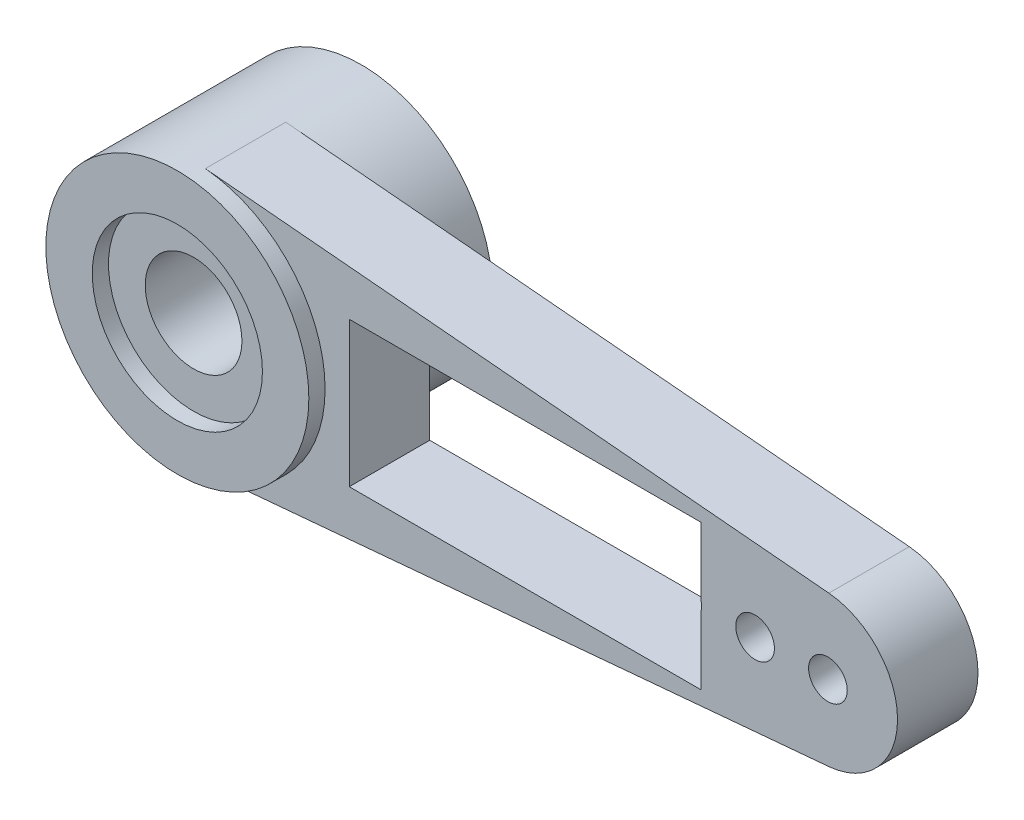
ISO-10303-21;
HEADER;
FILE_DESCRIPTION(('STEP AP214'),'2;1');
FILE_NAME('part.step','',(''),(''),'','','');
FILE_SCHEMA(('AUTOMOTIVE_DESIGN { 1 0 10303 214 1 1 1 1 }'));
ENDSEC;
DATA;
#1=APPLICATION_CONTEXT('core data for automotive mechanical design processes');
#2=APPLICATION_PROTOCOL_DEFINITION('international standard','automotive_design',2000,#1);
#3=PRODUCT_CONTEXT('',#1,'mechanical');
#4=PRODUCT('Part','Part','',(#3));
#5=PRODUCT_RELATED_PRODUCT_CATEGORY('part','',(#4));
#6=PRODUCT_DEFINITION_FORMATION('','',#4);
#7=PRODUCT_DEFINITION_CONTEXT('part definition',#1,'design');
#8=PRODUCT_DEFINITION('design','',#6,#7);
#9=PRODUCT_DEFINITION_SHAPE('','',#8);
#10=(LENGTH_UNIT() NAMED_UNIT(*) SI_UNIT(.MILLI.,.METRE.));
#11=(NAMED_UNIT(*) PLANE_ANGLE_UNIT() SI_UNIT($,.RADIAN.));
#12=(NAMED_UNIT(*) SI_UNIT($,.STERADIAN.) SOLID_ANGLE_UNIT());
#13=UNCERTAINTY_MEASURE_WITH_UNIT(LENGTH_MEASURE(1.E-05),#10,'distance_accuracy_value','');
#14=(GEOMETRIC_REPRESENTATION_CONTEXT(3) GLOBAL_UNCERTAINTY_ASSIGNED_CONTEXT((#13)) GLOBAL_UNIT_ASSIGNED_CONTEXT((#10,
#11,#12)) REPRESENTATION_CONTEXT('',''));
#15=CARTESIAN_POINT('',(0.,0.,0.));
#16=DIRECTION('',(0.,0.,1.));
#17=DIRECTION('',(1.,0.,0.));
#18=AXIS2_PLACEMENT_3D('',#15,#16,#17);
#19=CARTESIAN_POINT('',(0.,0.,2.08));
#20=DIRECTION('',(0.,0.,1.));
#21=DIRECTION('',(1.,0.,0.));
#22=AXIS2_PLACEMENT_3D('',#19,#20,#21);
#23=PLANE('',#22);
#24=CARTESIAN_POINT('',(0.,0.,2.08));
#25=DIRECTION('',(0.,0.,1.));
#26=DIRECTION('',(1.,0.,0.));
#27=AXIS2_PLACEMENT_3D('',#24,#25,#26);
#28=CIRCLE('',#27,1.25);
#29=CARTESIAN_POINT('',(1.25,0.,2.08));
#30=VERTEX_POINT('',#29);
#31=EDGE_CURVE('E206',#30,#30,#28,.T.);
#32=ORIENTED_EDGE('',*,*,#31,.F.);
#33=EDGE_LOOP('',(#32));
#34=FACE_BOUND('',#33,.T.);
#35=CARTESIAN_POINT('',(0.,0.,2.08));
#36=DIRECTION('',(0.,0.,1.));
#37=DIRECTION('',(1.,0.,0.));
#38=AXIS2_PLACEMENT_3D('',#35,#36,#37);
#39=CIRCLE('',#38,2.2);
#40=CARTESIAN_POINT('',(2.2,0.,2.08));
#41=VERTEX_POINT('',#40);
#42=EDGE_CURVE('E185',#41,#41,#39,.T.);
#43=ORIENTED_EDGE('',*,*,#42,.T.);
#44=EDGE_LOOP('',(#43));
#45=FACE_BOUND('',#44,.T.);
#46=ADVANCED_FACE('F42',(#34,#45),#23,.T.);
#47=CARTESIAN_POINT('',(0.,0.,0.));
#48=DIRECTION('',(0.,0.,1.));
#49=DIRECTION('',(1.,0.,0.));
#50=AXIS2_PLACEMENT_3D('',#47,#48,#49);
#51=PLANE('',#50);
#52=CARTESIAN_POINT('',(0.,0.,0.));
#53=DIRECTION('',(0.,0.,1.));
#54=DIRECTION('',(1.,0.,0.));
#55=AXIS2_PLACEMENT_3D('',#52,#53,#54);
#56=CIRCLE('',#55,1.25);
#57=CARTESIAN_POINT('',(1.25,0.,0.));
#58=VERTEX_POINT('',#57);
#59=EDGE_CURVE('E193',#58,#58,#56,.T.);
#60=ORIENTED_EDGE('',*,*,#59,.T.);
#61=EDGE_LOOP('',(#60));
#62=FACE_BOUND('',#61,.T.);
#63=CARTESIAN_POINT('',(0.,0.,0.));
#64=DIRECTION('',(0.,0.,1.));
#65=DIRECTION('',(1.,0.,0.));
#66=AXIS2_PLACEMENT_3D('',#63,#64,#65);
#67=CIRCLE('',#66,2.2);
#68=CARTESIAN_POINT('',(2.2,0.,0.));
#69=VERTEX_POINT('',#68);
#70=EDGE_CURVE('E50',#69,#69,#67,.T.);
#71=ORIENTED_EDGE('',*,*,#70,.F.);
#72=EDGE_LOOP('',(#71));
#73=FACE_BOUND('',#72,.T.);
#74=ADVANCED_FACE('F241',(#62,#73),#51,.F.);
#75=CARTESIAN_POINT('',(0.,0.,2.08));
#76=DIRECTION('',(0.,0.,-1.));
#77=DIRECTION('',(-1.,0.,0.));
#78=AXIS2_PLACEMENT_3D('',#75,#76,#77);
#79=CYLINDRICAL_SURFACE('',#78,1.25);
#80=ORIENTED_EDGE('',*,*,#31,.T.);
#81=EDGE_LOOP('',(#80));
#82=FACE_BOUND('',#81,.T.);
#83=ORIENTED_EDGE('',*,*,#59,.F.);
#84=EDGE_LOOP('',(#83));
#85=FACE_BOUND('',#84,.T.);
#86=ADVANCED_FACE('F243',(#82,#85),#79,.F.);
#87=CARTESIAN_POINT('',(0.,0.,-2.25));
#88=DIRECTION('',(0.,0.,1.));
#89=DIRECTION('',(1.,0.,0.));
#90=AXIS2_PLACEMENT_3D('',#87,#88,#89);
#91=CYLINDRICAL_SURFACE('',#90,2.2);
#92=CARTESIAN_POINT('',(0.,0.,-2.25));
#93=DIRECTION('',(0.,0.,1.));
#94=DIRECTION('',(1.,0.,0.));
#95=AXIS2_PLACEMENT_3D('',#92,#93,#94);
#96=CIRCLE('',#95,2.2);
#97=CARTESIAN_POINT('',(2.2,0.,-2.25));
#98=VERTEX_POINT('',#97);
#99=EDGE_CURVE('E178',#98,#98,#96,.T.);
#100=ORIENTED_EDGE('',*,*,#99,.F.);
#101=EDGE_LOOP('',(#100));
#102=FACE_BOUND('',#101,.T.);
#103=ORIENTED_EDGE('',*,*,#70,.T.);
#104=EDGE_LOOP('',(#103));
#105=FACE_BOUND('',#104,.T.);
#106=ADVANCED_FACE('F239',(#102,#105),#91,.F.);
#107=CARTESIAN_POINT('',(0.,0.,-2.25));
#108=DIRECTION('',(0.,0.,1.));
#109=DIRECTION('',(1.,0.,0.));
#110=AXIS2_PLACEMENT_3D('',#107,#108,#109);
#111=PLANE('',#110);
#112=ORIENTED_EDGE('',*,*,#99,.T.);
#113=EDGE_LOOP('',(#112));
#114=FACE_BOUND('',#113,.T.);
#115=CARTESIAN_POINT('',(0.,0.,-2.25));
#116=DIRECTION('',(0.,0.,1.));
#117=DIRECTION('',(1.,0.,0.));
#118=AXIS2_PLACEMENT_3D('',#115,#116,#117);
#119=CIRCLE('',#118,3.4);
#120=CARTESIAN_POINT('',(3.4,0.,-2.25));
#121=VERTEX_POINT('',#120);
#122=EDGE_CURVE('E181',#121,#121,#119,.T.);
#123=ORIENTED_EDGE('',*,*,#122,.F.);
#124=EDGE_LOOP('',(#123));
#125=FACE_BOUND('',#124,.T.);
#126=ADVANCED_FACE('F312',(#114,#125),#111,.F.);
#127=ORIENTED_EDGE('',*,*,#42,.F.);
#128=EDGE_LOOP('',(#127));
#129=FACE_BOUND('',#128,.T.);
#130=CARTESIAN_POINT('',(0.,0.,2.5));
#131=DIRECTION('',(0.,0.,1.));
#132=DIRECTION('',(1.,0.,0.));
#133=AXIS2_PLACEMENT_3D('',#130,#131,#132);
#134=CIRCLE('',#133,2.2);
#135=CARTESIAN_POINT('',(2.2,0.,2.5));
#136=VERTEX_POINT('',#135);
#137=EDGE_CURVE('E172',#136,#136,#134,.T.);
#138=ORIENTED_EDGE('',*,*,#137,.T.);
#139=EDGE_LOOP('',(#138));
#140=FACE_BOUND('',#139,.T.);
#141=ADVANCED_FACE('F306',(#129,#140),#91,.F.);
#142=CARTESIAN_POINT('',(0.,0.,2.5));
#143=DIRECTION('',(0.,0.,1.));
#144=DIRECTION('',(1.,0.,0.));
#145=AXIS2_PLACEMENT_3D('',#142,#143,#144);
#146=PLANE('',#145);
#147=ORIENTED_EDGE('',*,*,#137,.F.);
#148=EDGE_LOOP('',(#147));
#149=FACE_BOUND('',#148,.T.);
#150=CARTESIAN_POINT('',(0.,0.,2.5));
#151=DIRECTION('',(0.,0.,1.));
#152=DIRECTION('',(1.,0.,0.));
#153=AXIS2_PLACEMENT_3D('',#150,#151,#152);
#154=CIRCLE('',#153,3.4);
#155=CARTESIAN_POINT('',(3.4,0.,2.5));
#156=VERTEX_POINT('',#155);
#157=EDGE_CURVE('E175',#156,#156,#154,.T.);
#158=ORIENTED_EDGE('',*,*,#157,.T.);
#159=EDGE_LOOP('',(#158));
#160=FACE_BOUND('',#159,.T.);
#161=ADVANCED_FACE('F291',(#149,#160),#146,.T.);
#162=CARTESIAN_POINT('',(16.25,0.,2.08));
#163=DIRECTION('',(0.,0.,-1.));
#164=DIRECTION('',(-1.,0.,0.));
#165=AXIS2_PLACEMENT_3D('',#162,#163,#164);
#166=CYLINDRICAL_SURFACE('',#165,1.95);
#167=CARTESIAN_POINT('',(16.25,0.,0.));
#168=DIRECTION('',(0.,0.,1.));
#169=DIRECTION('',(1.,0.,0.));
#170=AXIS2_PLACEMENT_3D('',#167,#168,#169);
#171=CIRCLE('',#170,1.95);
#172=CARTESIAN_POINT('',(16.424,-1.94222140859378,0.));
#173=VERTEX_POINT('',#172);
#174=CARTESIAN_POINT('',(16.424,1.94222140859378,0.));
#175=VERTEX_POINT('',#174);
#176=EDGE_CURVE('E220',#173,#175,#171,.T.);
#177=ORIENTED_EDGE('',*,*,#176,.T.);
#178=DIRECTION('',(0.,0.,-1.));
#179=VECTOR('',#178,1.);
#180=CARTESIAN_POINT('',(16.424,1.94222140859378,2.08));
#181=LINE('',#180,#179);
#182=CARTESIAN_POINT('',(16.424,1.94222140859378,2.08));
#183=VERTEX_POINT('',#182);
#184=EDGE_CURVE('E232',#183,#175,#181,.T.);
#185=ORIENTED_EDGE('',*,*,#184,.F.);
#186=CARTESIAN_POINT('',(16.25,0.,2.08));
#187=DIRECTION('',(0.,0.,1.));
#188=DIRECTION('',(1.,0.,0.));
#189=AXIS2_PLACEMENT_3D('',#186,#187,#188);
#190=CIRCLE('',#189,1.95);
#191=CARTESIAN_POINT('',(16.424,-1.94222140859378,2.08));
#192=VERTEX_POINT('',#191);
#193=EDGE_CURVE('E201',#192,#183,#190,.T.);
#194=ORIENTED_EDGE('',*,*,#193,.F.);
#195=DIRECTION('',(0.,0.,-1.));
#196=VECTOR('',#195,1.);
#197=CARTESIAN_POINT('',(16.424,-1.94222140859378,2.08));
#198=LINE('',#197,#196);
#199=EDGE_CURVE('E90',#192,#173,#198,.T.);
#200=ORIENTED_EDGE('',*,*,#199,.T.);
#201=EDGE_LOOP('',(#177,#185,#194,#200));
#202=FACE_BOUND('',#201,.T.);
#203=ADVANCED_FACE('F288',(#202),#166,.T.);
#204=CARTESIAN_POINT('',(0.303384615384615,3.38643732780454,2.08));
#205=DIRECTION('',(-0.0892307692307693,-0.99601097876604,0.));
#206=DIRECTION('',(0.99601097876604,-0.0892307692307693,0.));
#207=AXIS2_PLACEMENT_3D('',#204,#205,#206);
#208=PLANE('',#207);
#209=DIRECTION('',(-0.99601097876604,0.0892307692307693,0.));
#210=VECTOR('',#209,1.);
#211=CARTESIAN_POINT('',(0.303384615384615,3.38643732780454,0.));
#212=LINE('',#211,#210);
#213=CARTESIAN_POINT('',(0.303384615384616,3.38643732780454,0.));
#214=VERTEX_POINT('',#213);
#215=EDGE_CURVE('E223',#175,#214,#212,.T.);
#216=ORIENTED_EDGE('',*,*,#215,.T.);
#217=DIRECTION('',(0.,0.,-1.));
#218=VECTOR('',#217,1.);
#219=CARTESIAN_POINT('',(0.303384615384616,3.38643732780454,2.08));
#220=LINE('',#219,#218);
#221=CARTESIAN_POINT('',(0.303384615384616,3.38643732780454,2.08));
#222=VERTEX_POINT('',#221);
#223=EDGE_CURVE('E230',#222,#214,#220,.T.);
#224=ORIENTED_EDGE('',*,*,#223,.F.);
#225=DIRECTION('',(-0.99601097876604,0.0892307692307693,0.));
#226=VECTOR('',#225,1.);
#227=CARTESIAN_POINT('',(0.303384615384615,3.38643732780454,2.08));
#228=LINE('',#227,#226);
#229=EDGE_CURVE('E204',#183,#222,#228,.T.);
#230=ORIENTED_EDGE('',*,*,#229,.F.);
#231=ORIENTED_EDGE('',*,*,#184,.T.);
#232=EDGE_LOOP('',(#216,#224,#230,#231));
#233=FACE_BOUND('',#232,.T.);
#234=ADVANCED_FACE('F290',(#233),#208,.F.);
#235=CARTESIAN_POINT('',(0.,0.,2.08));
#236=DIRECTION('',(0.,0.,-1.));
#237=DIRECTION('',(-1.,0.,0.));
#238=AXIS2_PLACEMENT_3D('',#235,#236,#237);
#239=CYLINDRICAL_SURFACE('',#238,3.4);
#240=ORIENTED_EDGE('',*,*,#223,.T.);
#241=CARTESIAN_POINT('',(0.,0.,0.));
#242=DIRECTION('',(0.,0.,1.));
#243=DIRECTION('',(1.,0.,0.));
#244=AXIS2_PLACEMENT_3D('',#241,#242,#243);
#245=CIRCLE('',#244,3.4);
#246=CARTESIAN_POINT('',(0.303384615384615,-3.38643732780453,0.));
#247=VERTEX_POINT('',#246);
#248=EDGE_CURVE('E84',#247,#214,#245,.T.);
#249=ORIENTED_EDGE('',*,*,#248,.F.);
#250=DIRECTION('',(0.,0.,-1.));
#251=VECTOR('',#250,1.);
#252=CARTESIAN_POINT('',(0.303384615384616,-3.38643732780454,2.08));
#253=LINE('',#252,#251);
#254=CARTESIAN_POINT('',(0.303384615384616,-3.38643732780454,2.08));
#255=VERTEX_POINT('',#254);
#256=EDGE_CURVE('E209',#255,#247,#253,.T.);
#257=ORIENTED_EDGE('',*,*,#256,.F.);
#258=CARTESIAN_POINT('',(0.,0.,2.08));
#259=DIRECTION('',(0.,0.,1.));
#260=DIRECTION('',(1.,0.,0.));
#261=AXIS2_PLACEMENT_3D('',#258,#259,#260);
#262=CIRCLE('',#261,3.4);
#263=EDGE_CURVE('E66',#255,#222,#262,.T.);
#264=ORIENTED_EDGE('',*,*,#263,.T.);
#265=EDGE_LOOP('',(#240,#249,#257,#264));
#266=FACE_BOUND('',#265,.T.);
#267=ORIENTED_EDGE('',*,*,#122,.T.);
#268=EDGE_LOOP('',(#267));
#269=FACE_BOUND('',#268,.T.);
#270=ORIENTED_EDGE('',*,*,#157,.F.);
#271=EDGE_LOOP('',(#270));
#272=FACE_BOUND('',#271,.T.);
#273=ADVANCED_FACE('F287',(#266,#269,#272),#239,.T.);
#274=CARTESIAN_POINT('',(0.303384615384616,-3.38643732780454,2.08));
#275=DIRECTION('',(0.0892307692307693,-0.99601097876604,0.));
#276=DIRECTION('',(0.99601097876604,0.0892307692307693,0.));
#277=AXIS2_PLACEMENT_3D('',#274,#275,#276);
#278=PLANE('',#277);
#279=DIRECTION('',(-0.99601097876604,-0.0892307692307693,0.));
#280=VECTOR('',#279,1.);
#281=CARTESIAN_POINT('',(0.303384615384616,-3.38643732780454,0.));
#282=LINE('',#281,#280);
#283=EDGE_CURVE('E218',#173,#247,#282,.T.);
#284=ORIENTED_EDGE('',*,*,#283,.F.);
#285=ORIENTED_EDGE('',*,*,#199,.F.);
#286=DIRECTION('',(-0.99601097876604,-0.0892307692307693,0.));
#287=VECTOR('',#286,1.);
#288=CARTESIAN_POINT('',(0.303384615384616,-3.38643732780454,2.08));
#289=LINE('',#288,#287);
#290=EDGE_CURVE('E199',#192,#255,#289,.T.);
#291=ORIENTED_EDGE('',*,*,#290,.T.);
#292=ORIENTED_EDGE('',*,*,#256,.T.);
#293=EDGE_LOOP('',(#284,#285,#291,#292));
#294=FACE_BOUND('',#293,.T.);
#295=ADVANCED_FACE('F281',(#294),#278,.T.);
#296=CARTESIAN_POINT('',(12.6333333333333,0.,2.08));
#297=DIRECTION('',(0.,0.,-1.));
#298=DIRECTION('',(-1.,0.,0.));
#299=AXIS2_PLACEMENT_3D('',#296,#297,#298);
#300=CYLINDRICAL_SURFACE('',#299,0.500000000000001);
#301=DIRECTION('',(0.,0.,-1.));
#302=VECTOR('',#301,1.);
#303=CARTESIAN_POINT('',(13.125,-0.0909059342886467,2.08));
#304=LINE('',#303,#302);
#305=CARTESIAN_POINT('',(13.125,-0.0909059342886467,2.08));
#306=VERTEX_POINT('',#305);
#307=CARTESIAN_POINT('',(13.125,-0.0909059342886467,0.));
#308=VERTEX_POINT('',#307);
#309=EDGE_CURVE('E170',#306,#308,#304,.T.);
#310=ORIENTED_EDGE('',*,*,#309,.F.);
#311=CARTESIAN_POINT('',(12.6333333333333,0.,2.08));
#312=DIRECTION('',(0.,0.,1.));
#313=DIRECTION('',(1.,0.,0.));
#314=AXIS2_PLACEMENT_3D('',#311,#312,#313);
#315=CIRCLE('',#314,0.500000000000001);
#316=CARTESIAN_POINT('',(13.125,0.0909059342886467,2.08));
#317=VERTEX_POINT('',#316);
#318=EDGE_CURVE('E196',#306,#317,#315,.T.);
#319=ORIENTED_EDGE('',*,*,#318,.T.);
#320=DIRECTION('',(0.,0.,-1.));
#321=VECTOR('',#320,1.);
#322=CARTESIAN_POINT('',(13.125,0.0909059342886467,2.08));
#323=LINE('',#322,#321);
#324=CARTESIAN_POINT('',(13.125,0.0909059342886465,0.));
#325=VERTEX_POINT('',#324);
#326=EDGE_CURVE('E167',#325,#317,#323,.F.);
#327=ORIENTED_EDGE('',*,*,#326,.F.);
#328=CARTESIAN_POINT('',(12.6333333333333,0.,0.));
#329=DIRECTION('',(0.,0.,1.));
#330=DIRECTION('',(1.,0.,0.));
#331=AXIS2_PLACEMENT_3D('',#328,#329,#330);
#332=CIRCLE('',#331,0.500000000000001);
#333=EDGE_CURVE('E215',#308,#325,#332,.T.);
#334=ORIENTED_EDGE('',*,*,#333,.F.);
#335=EDGE_LOOP('',(#310,#319,#327,#334));
#336=FACE_BOUND('',#335,.T.);
#337=ADVANCED_FACE('F274',(#336),#300,.F.);
#338=CARTESIAN_POINT('',(14.5166666666667,0.,2.08));
#339=DIRECTION('',(0.,0.,-1.));
#340=DIRECTION('',(-1.,0.,0.));
#341=AXIS2_PLACEMENT_3D('',#338,#339,#340);
#342=CYLINDRICAL_SURFACE('',#341,0.500000000000001);
#343=CARTESIAN_POINT('',(14.5166666666667,0.,2.08));
#344=DIRECTION('',(0.,0.,1.));
#345=DIRECTION('',(1.,0.,0.));
#346=AXIS2_PLACEMENT_3D('',#343,#344,#345);
#347=CIRCLE('',#346,0.500000000000001);
#348=CARTESIAN_POINT('',(15.0166666666667,0.,2.08));
#349=VERTEX_POINT('',#348);
#350=EDGE_CURVE('E192',#349,#349,#347,.T.);
#351=ORIENTED_EDGE('',*,*,#350,.T.);
#352=EDGE_LOOP('',(#351));
#353=FACE_BOUND('',#352,.T.);
#354=CARTESIAN_POINT('',(14.5166666666667,0.,0.));
#355=DIRECTION('',(0.,0.,1.));
#356=DIRECTION('',(1.,0.,0.));
#357=AXIS2_PLACEMENT_3D('',#354,#355,#356);
#358=CIRCLE('',#357,0.500000000000001);
#359=CARTESIAN_POINT('',(15.0166666666667,0.,0.));
#360=VERTEX_POINT('',#359);
#361=EDGE_CURVE('E212',#360,#360,#358,.T.);
#362=ORIENTED_EDGE('',*,*,#361,.F.);
#363=EDGE_LOOP('',(#362));
#364=FACE_BOUND('',#363,.T.);
#365=ADVANCED_FACE('F272',(#353,#364),#342,.F.);
#366=DIRECTION('',(0.,1.,0.));
#367=VECTOR('',#366,1.);
#368=CARTESIAN_POINT('',(13.125,0.,2.08));
#369=LINE('',#368,#367);
#370=CARTESIAN_POINT('',(13.125,-1.875,2.08));
#371=VERTEX_POINT('',#370);
#372=EDGE_CURVE('E168',#371,#306,#369,.T.);
#373=ORIENTED_EDGE('',*,*,#372,.F.);
#374=DIRECTION('',(1.,0.,0.));
#375=VECTOR('',#374,1.);
#376=CARTESIAN_POINT('',(0.,-1.875,2.08));
#377=LINE('',#376,#375);
#378=CARTESIAN_POINT('',(4.025,-1.875,2.08));
#379=VERTEX_POINT('',#378);
#380=EDGE_CURVE('E158',#379,#371,#377,.T.);
#381=ORIENTED_EDGE('',*,*,#380,.F.);
#382=DIRECTION('',(0.,-1.,0.));
#383=VECTOR('',#382,1.);
#384=CARTESIAN_POINT('',(4.025,0.,2.08));
#385=LINE('',#384,#383);
#386=CARTESIAN_POINT('',(4.025,1.875,2.08));
#387=VERTEX_POINT('',#386);
#388=EDGE_CURVE('E138',#387,#379,#385,.T.);
#389=ORIENTED_EDGE('',*,*,#388,.F.);
#390=DIRECTION('',(-1.,0.,0.));
#391=VECTOR('',#390,1.);
#392=CARTESIAN_POINT('',(0.,1.875,2.08));
#393=LINE('',#392,#391);
#394=CARTESIAN_POINT('',(13.125,1.875,2.08));
#395=VERTEX_POINT('',#394);
#396=EDGE_CURVE('E163',#395,#387,#393,.T.);
#397=ORIENTED_EDGE('',*,*,#396,.F.);
#398=EDGE_CURVE('E165',#317,#395,#369,.T.);
#399=ORIENTED_EDGE('',*,*,#398,.F.);
#400=ORIENTED_EDGE('',*,*,#318,.F.);
#401=EDGE_LOOP('',(#373,#381,#389,#397,#399,#400));
#402=FACE_BOUND('',#401,.T.);
#403=ORIENTED_EDGE('',*,*,#263,.F.);
#404=ORIENTED_EDGE('',*,*,#290,.F.);
#405=ORIENTED_EDGE('',*,*,#193,.T.);
#406=ORIENTED_EDGE('',*,*,#229,.T.);
#407=EDGE_LOOP('',(#403,#404,#405,#406));
#408=FACE_BOUND('',#407,.T.);
#409=CARTESIAN_POINT('',(16.4,0.,2.08));
#410=DIRECTION('',(0.,0.,1.));
#411=DIRECTION('',(1.,0.,0.));
#412=AXIS2_PLACEMENT_3D('',#409,#410,#411);
#413=CIRCLE('',#412,0.499999999999999);
#414=CARTESIAN_POINT('',(16.9,0.,2.08));
#415=VERTEX_POINT('',#414);
#416=EDGE_CURVE('E189',#415,#415,#413,.T.);
#417=ORIENTED_EDGE('',*,*,#416,.F.);
#418=EDGE_LOOP('',(#417));
#419=FACE_BOUND('',#418,.T.);
#420=ORIENTED_EDGE('',*,*,#350,.F.);
#421=EDGE_LOOP('',(#420));
#422=FACE_BOUND('',#421,.T.);
#423=ADVANCED_FACE('F255',(#402,#408,#419,#422),#23,.T.);
#424=CARTESIAN_POINT('',(16.4,0.,2.08));
#425=DIRECTION('',(0.,0.,-1.));
#426=DIRECTION('',(-1.,0.,0.));
#427=AXIS2_PLACEMENT_3D('',#424,#425,#426);
#428=CYLINDRICAL_SURFACE('',#427,0.499999999999999);
#429=ORIENTED_EDGE('',*,*,#416,.T.);
#430=EDGE_LOOP('',(#429));
#431=FACE_BOUND('',#430,.T.);
#432=CARTESIAN_POINT('',(16.4,0.,0.));
#433=DIRECTION('',(0.,0.,1.));
#434=DIRECTION('',(1.,0.,0.));
#435=AXIS2_PLACEMENT_3D('',#432,#433,#434);
#436=CIRCLE('',#435,0.499999999999999);
#437=CARTESIAN_POINT('',(16.9,0.,0.));
#438=VERTEX_POINT('',#437);
#439=EDGE_CURVE('E188',#438,#438,#436,.T.);
#440=ORIENTED_EDGE('',*,*,#439,.F.);
#441=EDGE_LOOP('',(#440));
#442=FACE_BOUND('',#441,.T.);
#443=ADVANCED_FACE('F44',(#431,#442),#428,.F.);
#444=ORIENTED_EDGE('',*,*,#439,.T.);
#445=EDGE_LOOP('',(#444));
#446=FACE_BOUND('',#445,.T.);
#447=ORIENTED_EDGE('',*,*,#361,.T.);
#448=EDGE_LOOP('',(#447));
#449=FACE_BOUND('',#448,.T.);
#450=DIRECTION('',(-1.,0.,0.));
#451=VECTOR('',#450,1.);
#452=CARTESIAN_POINT('',(4.025,-1.875,0.));
#453=LINE('',#452,#451);
#454=CARTESIAN_POINT('',(13.125,-1.875,0.));
#455=VERTEX_POINT('',#454);
#456=CARTESIAN_POINT('',(4.025,-1.875,0.));
#457=VERTEX_POINT('',#456);
#458=EDGE_CURVE('E143',#455,#457,#453,.T.);
#459=ORIENTED_EDGE('',*,*,#458,.F.);
#460=DIRECTION('',(0.,1.,0.));
#461=VECTOR('',#460,1.);
#462=CARTESIAN_POINT('',(13.125,0.,0.));
#463=LINE('',#462,#461);
#464=EDGE_CURVE('E11',#455,#308,#463,.T.);
#465=ORIENTED_EDGE('',*,*,#464,.T.);
#466=ORIENTED_EDGE('',*,*,#333,.T.);
#467=DIRECTION('',(0.,-1.,0.));
#468=VECTOR('',#467,1.);
#469=CARTESIAN_POINT('',(13.125,-1.875,0.));
#470=LINE('',#469,#468);
#471=CARTESIAN_POINT('',(13.125,1.875,0.));
#472=VERTEX_POINT('',#471);
#473=EDGE_CURVE('E146',#472,#325,#470,.T.);
#474=ORIENTED_EDGE('',*,*,#473,.F.);
#475=DIRECTION('',(1.,0.,0.));
#476=VECTOR('',#475,1.);
#477=CARTESIAN_POINT('',(4.025,1.875,0.));
#478=LINE('',#477,#476);
#479=CARTESIAN_POINT('',(4.025,1.875,0.));
#480=VERTEX_POINT('',#479);
#481=EDGE_CURVE('E151',#480,#472,#478,.T.);
#482=ORIENTED_EDGE('',*,*,#481,.F.);
#483=DIRECTION('',(0.,1.,0.));
#484=VECTOR('',#483,1.);
#485=CARTESIAN_POINT('',(4.025,-1.875,0.));
#486=LINE('',#485,#484);
#487=EDGE_CURVE('E135',#457,#480,#486,.T.);
#488=ORIENTED_EDGE('',*,*,#487,.F.);
#489=EDGE_LOOP('',(#459,#465,#466,#474,#482,#488));
#490=FACE_BOUND('',#489,.T.);
#491=ORIENTED_EDGE('',*,*,#283,.T.);
#492=ORIENTED_EDGE('',*,*,#248,.T.);
#493=ORIENTED_EDGE('',*,*,#215,.F.);
#494=ORIENTED_EDGE('',*,*,#176,.F.);
#495=EDGE_LOOP('',(#491,#492,#493,#494));
#496=FACE_BOUND('',#495,.T.);
#497=ADVANCED_FACE('F148',(#446,#449,#490,#496),#51,.F.);
#498=CARTESIAN_POINT('',(13.125,-1.875,10.));
#499=DIRECTION('',(1.,0.,0.));
#500=DIRECTION('',(0.,0.,-1.));
#501=AXIS2_PLACEMENT_3D('',#498,#499,#500);
#502=PLANE('',#501);
#503=ORIENTED_EDGE('',*,*,#309,.T.);
#504=ORIENTED_EDGE('',*,*,#464,.F.);
#505=DIRECTION('',(0.,0.,-1.));
#506=VECTOR('',#505,1.);
#507=CARTESIAN_POINT('',(13.125,-1.875,10.));
#508=LINE('',#507,#506);
#509=EDGE_CURVE('E57',#371,#455,#508,.T.);
#510=ORIENTED_EDGE('',*,*,#509,.F.);
#511=ORIENTED_EDGE('',*,*,#372,.T.);
#512=EDGE_LOOP('',(#503,#504,#510,#511));
#513=FACE_BOUND('',#512,.T.);
#514=ADVANCED_FACE('F257',(#513),#502,.F.);
#515=ORIENTED_EDGE('',*,*,#326,.T.);
#516=ORIENTED_EDGE('',*,*,#398,.T.);
#517=DIRECTION('',(0.,0.,-1.));
#518=VECTOR('',#517,1.);
#519=CARTESIAN_POINT('',(13.125,1.875,10.));
#520=LINE('',#519,#518);
#521=EDGE_CURVE('E156',#395,#472,#520,.T.);
#522=ORIENTED_EDGE('',*,*,#521,.T.);
#523=ORIENTED_EDGE('',*,*,#473,.T.);
#524=EDGE_LOOP('',(#515,#516,#522,#523));
#525=FACE_BOUND('',#524,.T.);
#526=ADVANCED_FACE('F263',(#525),#502,.F.);
#527=CARTESIAN_POINT('',(4.025,1.875,10.));
#528=DIRECTION('',(0.,1.,0.));
#529=DIRECTION('',(-1.,0.,0.));
#530=AXIS2_PLACEMENT_3D('',#527,#528,#529);
#531=PLANE('',#530);
#532=ORIENTED_EDGE('',*,*,#396,.T.);
#533=DIRECTION('',(0.,0.,-1.));
#534=VECTOR('',#533,1.);
#535=CARTESIAN_POINT('',(4.025,1.875,10.));
#536=LINE('',#535,#534);
#537=EDGE_CURVE('E140',#387,#480,#536,.T.);
#538=ORIENTED_EDGE('',*,*,#537,.T.);
#539=ORIENTED_EDGE('',*,*,#481,.T.);
#540=ORIENTED_EDGE('',*,*,#521,.F.);
#541=EDGE_LOOP('',(#532,#538,#539,#540));
#542=FACE_BOUND('',#541,.T.);
#543=ADVANCED_FACE('F370',(#542),#531,.F.);
#544=CARTESIAN_POINT('',(4.025,-1.875,10.));
#545=DIRECTION('',(-1.,0.,0.));
#546=DIRECTION('',(0.,0.,1.));
#547=AXIS2_PLACEMENT_3D('',#544,#545,#546);
#548=PLANE('',#547);
#549=ORIENTED_EDGE('',*,*,#388,.T.);
#550=DIRECTION('',(0.,0.,-1.));
#551=VECTOR('',#550,1.);
#552=CARTESIAN_POINT('',(4.025,-1.875,10.));
#553=LINE('',#552,#551);
#554=EDGE_CURVE('E131',#379,#457,#553,.T.);
#555=ORIENTED_EDGE('',*,*,#554,.T.);
#556=ORIENTED_EDGE('',*,*,#487,.T.);
#557=ORIENTED_EDGE('',*,*,#537,.F.);
#558=EDGE_LOOP('',(#549,#555,#556,#557));
#559=FACE_BOUND('',#558,.T.);
#560=ADVANCED_FACE('F132',(#559),#548,.F.);
#561=CARTESIAN_POINT('',(4.025,-1.875,10.));
#562=DIRECTION('',(0.,-1.,0.));
#563=DIRECTION('',(1.,0.,0.));
#564=AXIS2_PLACEMENT_3D('',#561,#562,#563);
#565=PLANE('',#564);
#566=ORIENTED_EDGE('',*,*,#380,.T.);
#567=ORIENTED_EDGE('',*,*,#509,.T.);
#568=ORIENTED_EDGE('',*,*,#458,.T.);
#569=ORIENTED_EDGE('',*,*,#554,.F.);
#570=EDGE_LOOP('',(#566,#567,#568,#569));
#571=FACE_BOUND('',#570,.T.);
#572=ADVANCED_FACE('F144',(#571),#565,.F.);
#573=CLOSED_SHELL('',(#46,#74,#86,#106,#126,#141,#161,#203,#234,#273,#295,#337,#365,#423,#443,
#497,#514,#526,#543,#560,#572));
#574=MANIFOLD_SOLID_BREP('B2',#573);
#575=ADVANCED_BREP_SHAPE_REPRESENTATION('',(#18,#574),#14);
#576=SHAPE_DEFINITION_REPRESENTATION(#9,#575);
ENDSEC;
END-ISO-10303-21;
